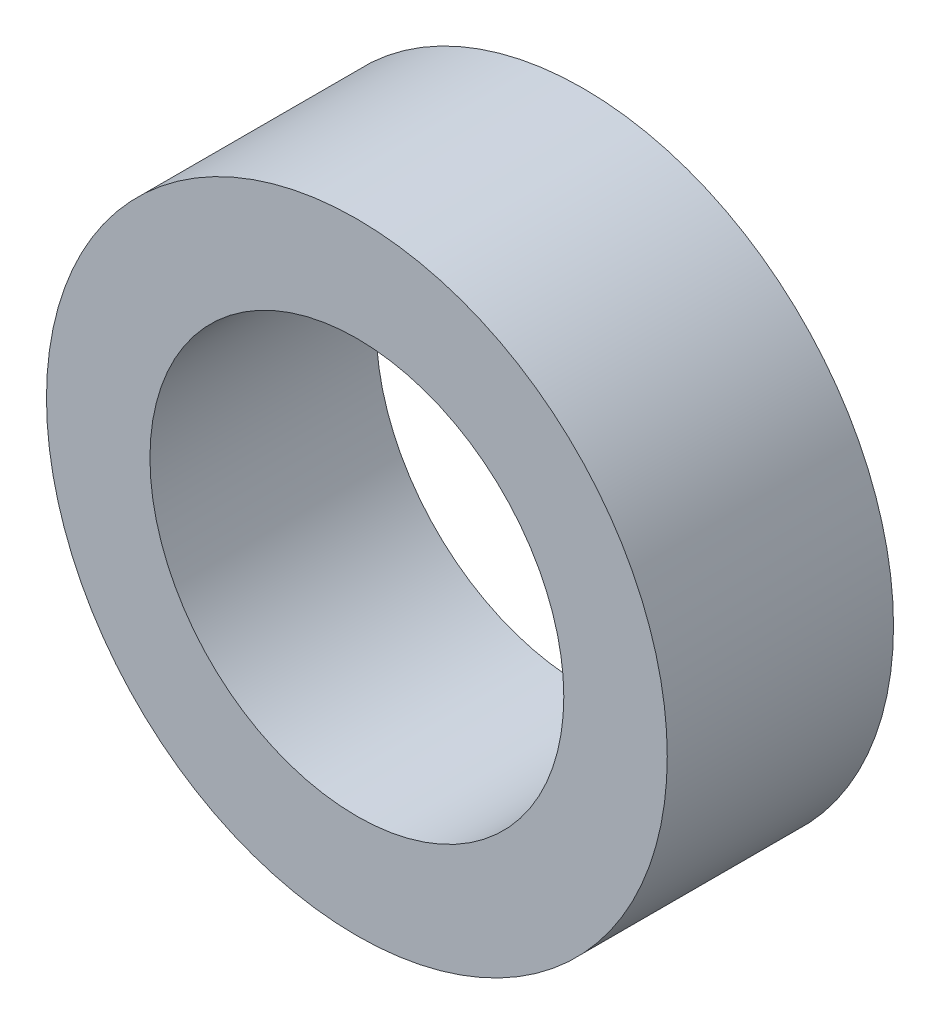
ISO-10303-21;
HEADER;
FILE_DESCRIPTION(('STEP AP214'),'2;1');
FILE_NAME('part.step','',(''),(''),'','','');
FILE_SCHEMA(('AUTOMOTIVE_DESIGN { 1 0 10303 214 1 1 1 1 }'));
ENDSEC;
DATA;
#1=APPLICATION_CONTEXT('core data for automotive mechanical design processes');
#2=APPLICATION_PROTOCOL_DEFINITION('international standard','automotive_design',2000,#1);
#3=PRODUCT_CONTEXT('',#1,'mechanical');
#4=PRODUCT('Part','Part','',(#3));
#5=PRODUCT_RELATED_PRODUCT_CATEGORY('part','',(#4));
#6=PRODUCT_DEFINITION_FORMATION('','',#4);
#7=PRODUCT_DEFINITION_CONTEXT('part definition',#1,'design');
#8=PRODUCT_DEFINITION('design','',#6,#7);
#9=PRODUCT_DEFINITION_SHAPE('','',#8);
#10=(LENGTH_UNIT() NAMED_UNIT(*) SI_UNIT(.MILLI.,.METRE.));
#11=(NAMED_UNIT(*) PLANE_ANGLE_UNIT() SI_UNIT($,.RADIAN.));
#12=(NAMED_UNIT(*) SI_UNIT($,.STERADIAN.) SOLID_ANGLE_UNIT());
#13=UNCERTAINTY_MEASURE_WITH_UNIT(LENGTH_MEASURE(1.E-05),#10,'distance_accuracy_value','');
#14=(GEOMETRIC_REPRESENTATION_CONTEXT(3) GLOBAL_UNCERTAINTY_ASSIGNED_CONTEXT((#13)) GLOBAL_UNIT_ASSIGNED_CONTEXT((#10,
#11,#12)) REPRESENTATION_CONTEXT('',''));
#15=CARTESIAN_POINT('',(0.,0.,0.));
#16=DIRECTION('',(0.,0.,1.));
#17=DIRECTION('',(1.,0.,0.));
#18=AXIS2_PLACEMENT_3D('',#15,#16,#17);
#19=CARTESIAN_POINT('',(-17.7,-16.75,1.64));
#20=DIRECTION('',(0.,0.,1.));
#21=DIRECTION('',(1.,0.,0.));
#22=AXIS2_PLACEMENT_3D('',#19,#20,#21);
#23=PLANE('',#22);
#24=CARTESIAN_POINT('',(-2.5,-31.,1.64));
#25=DIRECTION('',(0.,0.,1.));
#26=DIRECTION('',(1.,0.,0.));
#27=AXIS2_PLACEMENT_3D('',#24,#25,#26);
#28=CIRCLE('',#27,1.5);
#29=CARTESIAN_POINT('',(-1.,-31.,1.64));
#30=VERTEX_POINT('',#29);
#31=EDGE_CURVE('E51',#30,#30,#28,.T.);
#32=ORIENTED_EDGE('',*,*,#31,.F.);
#33=EDGE_LOOP('',(#32));
#34=FACE_BOUND('',#33,.T.);
#35=CARTESIAN_POINT('',(-2.5,-31.,1.64));
#36=DIRECTION('',(0.,0.,1.));
#37=DIRECTION('',(1.,0.,0.));
#38=AXIS2_PLACEMENT_3D('',#35,#36,#37);
#39=CIRCLE('',#38,2.25);
#40=CARTESIAN_POINT('',(-0.25,-31.,1.64));
#41=VERTEX_POINT('',#40);
#42=EDGE_CURVE('E11',#41,#41,#39,.T.);
#43=ORIENTED_EDGE('',*,*,#42,.T.);
#44=EDGE_LOOP('',(#43));
#45=FACE_BOUND('',#44,.T.);
#46=ADVANCED_FACE('F17',(#34,#45),#23,.T.);
#47=CARTESIAN_POINT('',(-17.7,-16.75,0.));
#48=DIRECTION('',(0.,0.,1.));
#49=DIRECTION('',(1.,0.,0.));
#50=AXIS2_PLACEMENT_3D('',#47,#48,#49);
#51=PLANE('',#50);
#52=CARTESIAN_POINT('',(-2.5,-31.,0.));
#53=DIRECTION('',(0.,0.,1.));
#54=DIRECTION('',(1.,0.,0.));
#55=AXIS2_PLACEMENT_3D('',#52,#53,#54);
#56=CIRCLE('',#55,1.5);
#57=CARTESIAN_POINT('',(-1.,-31.,0.));
#58=VERTEX_POINT('',#57);
#59=EDGE_CURVE('E45',#58,#58,#56,.T.);
#60=ORIENTED_EDGE('',*,*,#59,.T.);
#61=EDGE_LOOP('',(#60));
#62=FACE_BOUND('',#61,.T.);
#63=CARTESIAN_POINT('',(-2.5,-31.,0.));
#64=DIRECTION('',(0.,0.,1.));
#65=DIRECTION('',(1.,0.,0.));
#66=AXIS2_PLACEMENT_3D('',#63,#64,#65);
#67=CIRCLE('',#66,2.25);
#68=CARTESIAN_POINT('',(-0.25,-31.,0.));
#69=VERTEX_POINT('',#68);
#70=EDGE_CURVE('E26',#69,#69,#67,.T.);
#71=ORIENTED_EDGE('',*,*,#70,.F.);
#72=EDGE_LOOP('',(#71));
#73=FACE_BOUND('',#72,.T.);
#74=ADVANCED_FACE('F81',(#62,#73),#51,.F.);
#75=CARTESIAN_POINT('',(-2.5,-31.,1.64));
#76=DIRECTION('',(0.,0.,1.));
#77=DIRECTION('',(-1.,0.,0.));
#78=AXIS2_PLACEMENT_3D('',#75,#76,#77);
#79=CYLINDRICAL_SURFACE('',#78,2.25);
#80=ORIENTED_EDGE('',*,*,#42,.F.);
#81=EDGE_LOOP('',(#80));
#82=FACE_BOUND('',#81,.T.);
#83=ORIENTED_EDGE('',*,*,#70,.T.);
#84=EDGE_LOOP('',(#83));
#85=FACE_BOUND('',#84,.T.);
#86=ADVANCED_FACE('F71',(#82,#85),#79,.T.);
#87=CARTESIAN_POINT('',(-2.5,-31.,1.64));
#88=DIRECTION('',(0.,0.,1.));
#89=DIRECTION('',(-1.,0.,0.));
#90=AXIS2_PLACEMENT_3D('',#87,#88,#89);
#91=CYLINDRICAL_SURFACE('',#90,1.5);
#92=ORIENTED_EDGE('',*,*,#31,.T.);
#93=EDGE_LOOP('',(#92));
#94=FACE_BOUND('',#93,.T.);
#95=ORIENTED_EDGE('',*,*,#59,.F.);
#96=EDGE_LOOP('',(#95));
#97=FACE_BOUND('',#96,.T.);
#98=ADVANCED_FACE('F52',(#94,#97),#91,.F.);
#99=CLOSED_SHELL('',(#46,#74,#86,#98));
#100=MANIFOLD_SOLID_BREP('B1',#99);
#101=ADVANCED_BREP_SHAPE_REPRESENTATION('',(#18,#100),#14);
#102=SHAPE_DEFINITION_REPRESENTATION(#9,#101);
ENDSEC;
END-ISO-10303-21;
